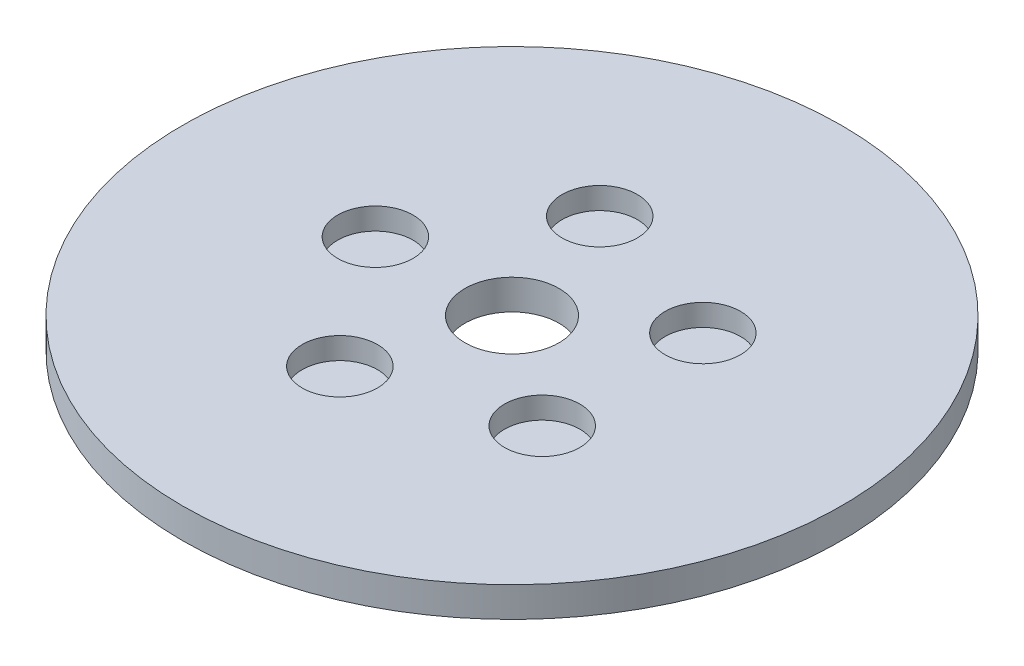
ISO-10303-21;
HEADER;
FILE_DESCRIPTION(('STEP AP214'),'2;1');
FILE_NAME('part.step','',(''),(''),'','','');
FILE_SCHEMA(('AUTOMOTIVE_DESIGN { 1 0 10303 214 1 1 1 1 }'));
ENDSEC;
DATA;
#1=APPLICATION_CONTEXT('core data for automotive mechanical design processes');
#2=APPLICATION_PROTOCOL_DEFINITION('international standard','automotive_design',2000,#1);
#3=PRODUCT_CONTEXT('',#1,'mechanical');
#4=PRODUCT('Part','Part','',(#3));
#5=PRODUCT_RELATED_PRODUCT_CATEGORY('part','',(#4));
#6=PRODUCT_DEFINITION_FORMATION('','',#4);
#7=PRODUCT_DEFINITION_CONTEXT('part definition',#1,'design');
#8=PRODUCT_DEFINITION('design','',#6,#7);
#9=PRODUCT_DEFINITION_SHAPE('','',#8);
#10=(LENGTH_UNIT() NAMED_UNIT(*) SI_UNIT(.MILLI.,.METRE.));
#11=(NAMED_UNIT(*) PLANE_ANGLE_UNIT() SI_UNIT($,.RADIAN.));
#12=(NAMED_UNIT(*) SI_UNIT($,.STERADIAN.) SOLID_ANGLE_UNIT());
#13=UNCERTAINTY_MEASURE_WITH_UNIT(LENGTH_MEASURE(1.E-05),#10,'distance_accuracy_value','');
#14=(GEOMETRIC_REPRESENTATION_CONTEXT(3) GLOBAL_UNCERTAINTY_ASSIGNED_CONTEXT((#13)) GLOBAL_UNIT_ASSIGNED_CONTEXT((#10,
#11,#12)) REPRESENTATION_CONTEXT('',''));
#15=CARTESIAN_POINT('',(0.,0.,0.));
#16=DIRECTION('',(0.,0.,1.));
#17=DIRECTION('',(1.,0.,0.));
#18=AXIS2_PLACEMENT_3D('',#15,#16,#17);
#19=CARTESIAN_POINT('',(0.,8.,0.));
#20=DIRECTION('',(0.,-1.,0.));
#21=DIRECTION('',(0.,0.,-1.));
#22=AXIS2_PLACEMENT_3D('',#19,#20,#21);
#23=CYLINDRICAL_SURFACE('',#22,87.5);
#24=CARTESIAN_POINT('',(0.,8.,0.));
#25=DIRECTION('',(0.,1.,0.));
#26=DIRECTION('',(0.,0.,1.));
#27=AXIS2_PLACEMENT_3D('',#24,#25,#26);
#28=CIRCLE('',#27,87.5);
#29=CARTESIAN_POINT('',(0.,8.,87.5));
#30=VERTEX_POINT('',#29);
#31=EDGE_CURVE('E10',#30,#30,#28,.T.);
#32=ORIENTED_EDGE('',*,*,#31,.F.);
#33=EDGE_LOOP('',(#32));
#34=FACE_BOUND('',#33,.T.);
#35=CARTESIAN_POINT('',(0.,0.,0.));
#36=DIRECTION('',(0.,1.,0.));
#37=DIRECTION('',(0.,0.,1.));
#38=AXIS2_PLACEMENT_3D('',#35,#36,#37);
#39=CIRCLE('',#38,87.5);
#40=CARTESIAN_POINT('',(0.,0.,87.5));
#41=VERTEX_POINT('',#40);
#42=EDGE_CURVE('E37',#41,#41,#39,.T.);
#43=ORIENTED_EDGE('',*,*,#42,.T.);
#44=EDGE_LOOP('',(#43));
#45=FACE_BOUND('',#44,.T.);
#46=ADVANCED_FACE('F40',(#34,#45),#23,.T.);
#47=CARTESIAN_POINT('',(0.,8.,0.));
#48=DIRECTION('',(0.,1.,0.));
#49=DIRECTION('',(0.,0.,1.));
#50=AXIS2_PLACEMENT_3D('',#47,#48,#49);
#51=PLANE('',#50);
#52=CARTESIAN_POINT('',(-11.2094763223504,8.,-34.4992207376524));
#53=DIRECTION('',(0.,1.,0.));
#54=DIRECTION('',(-0.95105651629515,0.,0.309016994374958));
#55=AXIS2_PLACEMENT_3D('',#52,#53,#54);
#56=CIRCLE('',#55,10.);
#57=CARTESIAN_POINT('',(-20.7200414853019,8.,-31.4090507939028));
#58=VERTEX_POINT('',#57);
#59=EDGE_CURVE('E70',#58,#58,#56,.T.);
#60=ORIENTED_EDGE('',*,*,#59,.F.);
#61=EDGE_LOOP('',(#60));
#62=FACE_BOUND('',#61,.T.);
#63=CARTESIAN_POINT('',(29.3467900079994,8.,-21.3216910012548));
#64=DIRECTION('',(0.,1.,0.));
#65=DIRECTION('',(-0.58778525229248,0.,-0.809016994374942));
#66=AXIS2_PLACEMENT_3D('',#63,#64,#65);
#67=CIRCLE('',#66,10.);
#68=CARTESIAN_POINT('',(23.4689374850746,8.,-29.4118609450042));
#69=VERTEX_POINT('',#68);
#70=EDGE_CURVE('E71',#69,#69,#67,.T.);
#71=ORIENTED_EDGE('',*,*,#70,.F.);
#72=EDGE_LOOP('',(#71));
#73=FACE_BOUND('',#72,.T.);
#74=CARTESIAN_POINT('',(29.3467900079997,8.,21.3216910012543));
#75=DIRECTION('',(0.,1.,0.));
#76=DIRECTION('',(0.587785252292469,0.,-0.809016994374951));
#77=AXIS2_PLACEMENT_3D('',#74,#75,#76);
#78=CIRCLE('',#77,10.);
#79=CARTESIAN_POINT('',(35.2246425309244,8.,13.2315210575048));
#80=VERTEX_POINT('',#79);
#81=EDGE_CURVE('E78',#80,#80,#78,.T.);
#82=ORIENTED_EDGE('',*,*,#81,.F.);
#83=EDGE_LOOP('',(#82));
#84=FACE_BOUND('',#83,.T.);
#85=CARTESIAN_POINT('',(-11.20947632235,8.,34.4992207376526));
#86=DIRECTION('',(0.,1.,0.));
#87=DIRECTION('',(0.951056516295155,0.,0.309016994374945));
#88=AXIS2_PLACEMENT_3D('',#85,#86,#87);
#89=CIRCLE('',#88,10.);
#90=CARTESIAN_POINT('',(-1.69891115939841,8.,37.589390681402));
#91=VERTEX_POINT('',#90);
#92=EDGE_CURVE('E61',#91,#91,#89,.T.);
#93=ORIENTED_EDGE('',*,*,#92,.F.);
#94=EDGE_LOOP('',(#93));
#95=FACE_BOUND('',#94,.T.);
#96=CARTESIAN_POINT('',(-36.2746273712991,8.,0.));
#97=DIRECTION('',(0.,1.,0.));
#98=DIRECTION('',(0.,0.,1.));
#99=AXIS2_PLACEMENT_3D('',#96,#97,#98);
#100=CIRCLE('',#99,10.);
#101=CARTESIAN_POINT('',(-36.2746273712991,8.,10.));
#102=VERTEX_POINT('',#101);
#103=EDGE_CURVE('E54',#102,#102,#100,.T.);
#104=ORIENTED_EDGE('',*,*,#103,.F.);
#105=EDGE_LOOP('',(#104));
#106=FACE_BOUND('',#105,.T.);
#107=CARTESIAN_POINT('',(0.,8.,0.));
#108=DIRECTION('',(0.,1.,0.));
#109=DIRECTION('',(0.,0.,1.));
#110=AXIS2_PLACEMENT_3D('',#107,#108,#109);
#111=CIRCLE('',#110,12.5);
#112=CARTESIAN_POINT('',(0.,8.,12.5));
#113=VERTEX_POINT('',#112);
#114=EDGE_CURVE('E50',#113,#113,#111,.T.);
#115=ORIENTED_EDGE('',*,*,#114,.F.);
#116=EDGE_LOOP('',(#115));
#117=FACE_BOUND('',#116,.T.);
#118=ORIENTED_EDGE('',*,*,#31,.T.);
#119=EDGE_LOOP('',(#118));
#120=FACE_BOUND('',#119,.T.);
#121=ADVANCED_FACE('F94',(#62,#73,#84,#95,#106,#117,#120),#51,.T.);
#122=CARTESIAN_POINT('',(0.,0.,0.));
#123=DIRECTION('',(0.,1.,0.));
#124=DIRECTION('',(0.,0.,1.));
#125=AXIS2_PLACEMENT_3D('',#122,#123,#124);
#126=PLANE('',#125);
#127=CARTESIAN_POINT('',(0.,0.,0.));
#128=DIRECTION('',(0.,1.,0.));
#129=DIRECTION('',(0.,0.,1.));
#130=AXIS2_PLACEMENT_3D('',#127,#128,#129);
#131=CIRCLE('',#130,12.5);
#132=CARTESIAN_POINT('',(0.,0.,12.5));
#133=VERTEX_POINT('',#132);
#134=EDGE_CURVE('E47',#133,#133,#131,.T.);
#135=ORIENTED_EDGE('',*,*,#134,.T.);
#136=EDGE_LOOP('',(#135));
#137=FACE_BOUND('',#136,.T.);
#138=ORIENTED_EDGE('',*,*,#42,.F.);
#139=EDGE_LOOP('',(#138));
#140=FACE_BOUND('',#139,.T.);
#141=ADVANCED_FACE('F100',(#137,#140),#126,.F.);
#142=CARTESIAN_POINT('',(0.,8.,0.));
#143=DIRECTION('',(0.,-1.,0.));
#144=DIRECTION('',(0.,0.,-1.));
#145=AXIS2_PLACEMENT_3D('',#142,#143,#144);
#146=CYLINDRICAL_SURFACE('',#145,12.5);
#147=ORIENTED_EDGE('',*,*,#114,.T.);
#148=EDGE_LOOP('',(#147));
#149=FACE_BOUND('',#148,.T.);
#150=ORIENTED_EDGE('',*,*,#134,.F.);
#151=EDGE_LOOP('',(#150));
#152=FACE_BOUND('',#151,.T.);
#153=ADVANCED_FACE('F106',(#149,#152),#146,.F.);
#154=CARTESIAN_POINT('',(-36.2746273712991,2.21913968005608,0.));
#155=DIRECTION('',(0.,1.,0.));
#156=DIRECTION('',(0.,0.,1.));
#157=AXIS2_PLACEMENT_3D('',#154,#155,#156);
#158=CYLINDRICAL_SURFACE('',#157,10.);
#159=CARTESIAN_POINT('',(-36.2746273712991,2.21913968005608,0.));
#160=DIRECTION('',(0.,1.,0.));
#161=DIRECTION('',(0.,0.,1.));
#162=AXIS2_PLACEMENT_3D('',#159,#160,#161);
#163=CIRCLE('',#162,10.);
#164=CARTESIAN_POINT('',(-36.2746273712991,2.21913968005608,10.));
#165=VERTEX_POINT('',#164);
#166=EDGE_CURVE('E55',#165,#165,#163,.T.);
#167=ORIENTED_EDGE('',*,*,#166,.F.);
#168=EDGE_LOOP('',(#167));
#169=FACE_BOUND('',#168,.T.);
#170=ORIENTED_EDGE('',*,*,#103,.T.);
#171=EDGE_LOOP('',(#170));
#172=FACE_BOUND('',#171,.T.);
#173=ADVANCED_FACE('F108',(#169,#172),#158,.F.);
#174=CARTESIAN_POINT('',(-36.2746273712991,2.21913968005608,0.));
#175=DIRECTION('',(0.,1.,0.));
#176=DIRECTION('',(0.,0.,1.));
#177=AXIS2_PLACEMENT_3D('',#174,#175,#176);
#178=PLANE('',#177);
#179=ORIENTED_EDGE('',*,*,#166,.T.);
#180=EDGE_LOOP('',(#179));
#181=FACE_BOUND('',#180,.T.);
#182=ADVANCED_FACE('F138',(#181),#178,.T.);
#183=CARTESIAN_POINT('',(-11.20947632235,2.21913968005608,34.4992207376526));
#184=DIRECTION('',(0.,1.,0.));
#185=DIRECTION('',(0.,0.,1.));
#186=AXIS2_PLACEMENT_3D('',#183,#184,#185);
#187=CYLINDRICAL_SURFACE('',#186,10.);
#188=CARTESIAN_POINT('',(-11.20947632235,2.21913968005608,34.4992207376526));
#189=DIRECTION('',(0.,1.,0.));
#190=DIRECTION('',(0.951056516295155,0.,0.309016994374945));
#191=AXIS2_PLACEMENT_3D('',#188,#189,#190);
#192=CIRCLE('',#191,10.);
#193=CARTESIAN_POINT('',(-1.69891115939841,2.21913968005608,37.589390681402));
#194=VERTEX_POINT('',#193);
#195=EDGE_CURVE('E59',#194,#194,#192,.T.);
#196=ORIENTED_EDGE('',*,*,#195,.F.);
#197=EDGE_LOOP('',(#196));
#198=FACE_BOUND('',#197,.T.);
#199=ORIENTED_EDGE('',*,*,#92,.T.);
#200=EDGE_LOOP('',(#199));
#201=FACE_BOUND('',#200,.T.);
#202=ADVANCED_FACE('F150',(#198,#201),#187,.F.);
#203=CARTESIAN_POINT('',(-11.20947632235,2.21913968005608,34.4992207376526));
#204=DIRECTION('',(0.,1.,0.));
#205=DIRECTION('',(0.951056516295155,0.,0.309016994374945));
#206=AXIS2_PLACEMENT_3D('',#203,#204,#205);
#207=PLANE('',#206);
#208=ORIENTED_EDGE('',*,*,#195,.T.);
#209=EDGE_LOOP('',(#208));
#210=FACE_BOUND('',#209,.T.);
#211=ADVANCED_FACE('F89',(#210),#207,.T.);
#212=CARTESIAN_POINT('',(29.3467900079997,2.21913968005608,21.3216910012543));
#213=DIRECTION('',(0.,1.,0.));
#214=DIRECTION('',(0.,0.,1.));
#215=AXIS2_PLACEMENT_3D('',#212,#213,#214);
#216=CYLINDRICAL_SURFACE('',#215,10.);
#217=CARTESIAN_POINT('',(29.3467900079997,2.21913968005608,21.3216910012543));
#218=DIRECTION('',(0.,1.,0.));
#219=DIRECTION('',(0.587785252292469,0.,-0.809016994374951));
#220=AXIS2_PLACEMENT_3D('',#217,#218,#219);
#221=CIRCLE('',#220,10.);
#222=CARTESIAN_POINT('',(35.2246425309244,2.21913968005608,13.2315210575048));
#223=VERTEX_POINT('',#222);
#224=EDGE_CURVE('E63',#223,#223,#221,.T.);
#225=ORIENTED_EDGE('',*,*,#224,.F.);
#226=EDGE_LOOP('',(#225));
#227=FACE_BOUND('',#226,.T.);
#228=ORIENTED_EDGE('',*,*,#81,.T.);
#229=EDGE_LOOP('',(#228));
#230=FACE_BOUND('',#229,.T.);
#231=ADVANCED_FACE('F87',(#227,#230),#216,.F.);
#232=CARTESIAN_POINT('',(29.3467900079997,2.21913968005608,21.3216910012543));
#233=DIRECTION('',(0.,1.,0.));
#234=DIRECTION('',(0.587785252292469,0.,-0.809016994374951));
#235=AXIS2_PLACEMENT_3D('',#232,#233,#234);
#236=PLANE('',#235);
#237=ORIENTED_EDGE('',*,*,#224,.T.);
#238=EDGE_LOOP('',(#237));
#239=FACE_BOUND('',#238,.T.);
#240=ADVANCED_FACE('F84',(#239),#236,.T.);
#241=CARTESIAN_POINT('',(29.3467900079994,2.21913968005608,-21.3216910012548));
#242=DIRECTION('',(0.,1.,0.));
#243=DIRECTION('',(0.,0.,1.));
#244=AXIS2_PLACEMENT_3D('',#241,#242,#243);
#245=CYLINDRICAL_SURFACE('',#244,10.);
#246=CARTESIAN_POINT('',(29.3467900079994,2.21913968005608,-21.3216910012548));
#247=DIRECTION('',(0.,1.,0.));
#248=DIRECTION('',(-0.58778525229248,0.,-0.809016994374942));
#249=AXIS2_PLACEMENT_3D('',#246,#247,#248);
#250=CIRCLE('',#249,10.);
#251=CARTESIAN_POINT('',(23.4689374850746,2.21913968005608,-29.4118609450042));
#252=VERTEX_POINT('',#251);
#253=EDGE_CURVE('E76',#252,#252,#250,.T.);
#254=ORIENTED_EDGE('',*,*,#253,.F.);
#255=EDGE_LOOP('',(#254));
#256=FACE_BOUND('',#255,.T.);
#257=ORIENTED_EDGE('',*,*,#70,.T.);
#258=EDGE_LOOP('',(#257));
#259=FACE_BOUND('',#258,.T.);
#260=ADVANCED_FACE('F185',(#256,#259),#245,.F.);
#261=CARTESIAN_POINT('',(29.3467900079994,2.21913968005608,-21.3216910012548));
#262=DIRECTION('',(0.,1.,0.));
#263=DIRECTION('',(-0.58778525229248,0.,-0.809016994374942));
#264=AXIS2_PLACEMENT_3D('',#261,#262,#263);
#265=PLANE('',#264);
#266=ORIENTED_EDGE('',*,*,#253,.T.);
#267=EDGE_LOOP('',(#266));
#268=FACE_BOUND('',#267,.T.);
#269=ADVANCED_FACE('F189',(#268),#265,.T.);
#270=CARTESIAN_POINT('',(-11.2094763223504,2.21913968005608,-34.4992207376524));
#271=DIRECTION('',(0.,1.,0.));
#272=DIRECTION('',(0.,0.,1.));
#273=AXIS2_PLACEMENT_3D('',#270,#271,#272);
#274=CYLINDRICAL_SURFACE('',#273,10.);
#275=CARTESIAN_POINT('',(-11.2094763223504,2.21913968005608,-34.4992207376524));
#276=DIRECTION('',(0.,1.,0.));
#277=DIRECTION('',(-0.95105651629515,0.,0.309016994374958));
#278=AXIS2_PLACEMENT_3D('',#275,#276,#277);
#279=CIRCLE('',#278,10.);
#280=CARTESIAN_POINT('',(-20.7200414853019,2.21913968005608,-31.4090507939028));
#281=VERTEX_POINT('',#280);
#282=EDGE_CURVE('E69',#281,#281,#279,.T.);
#283=ORIENTED_EDGE('',*,*,#282,.F.);
#284=EDGE_LOOP('',(#283));
#285=FACE_BOUND('',#284,.T.);
#286=ORIENTED_EDGE('',*,*,#59,.T.);
#287=EDGE_LOOP('',(#286));
#288=FACE_BOUND('',#287,.T.);
#289=ADVANCED_FACE('F200',(#285,#288),#274,.F.);
#290=CARTESIAN_POINT('',(-11.2094763223504,2.21913968005608,-34.4992207376524));
#291=DIRECTION('',(0.,1.,0.));
#292=DIRECTION('',(-0.95105651629515,0.,0.309016994374958));
#293=AXIS2_PLACEMENT_3D('',#290,#291,#292);
#294=PLANE('',#293);
#295=ORIENTED_EDGE('',*,*,#282,.T.);
#296=EDGE_LOOP('',(#295));
#297=FACE_BOUND('',#296,.T.);
#298=ADVANCED_FACE('F208',(#297),#294,.T.);
#299=CLOSED_SHELL('',(#46,#121,#141,#153,#173,#182,#202,#211,#231,#240,#260,#269,#289,#298));
#300=MANIFOLD_SOLID_BREP('B2',#299);
#301=ADVANCED_BREP_SHAPE_REPRESENTATION('',(#18,#300),#14);
#302=SHAPE_DEFINITION_REPRESENTATION(#9,#301);
ENDSEC;
END-ISO-10303-21;
